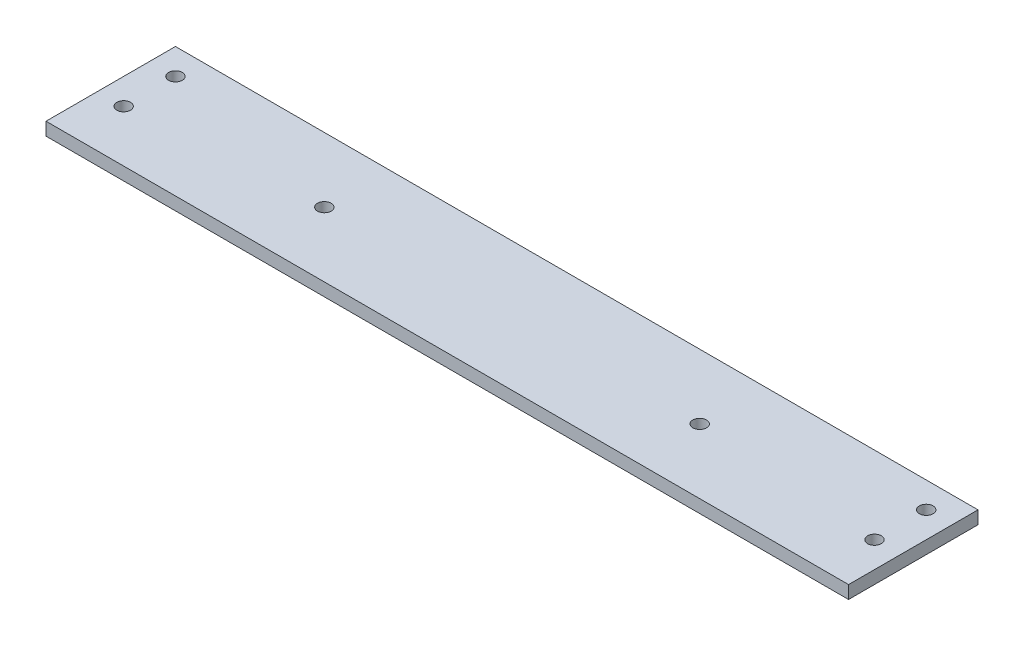
ISO-10303-21;
HEADER;
FILE_DESCRIPTION(('STEP AP214'),'2;1');
FILE_NAME('part.step','',(''),(''),'','','');
FILE_SCHEMA(('AUTOMOTIVE_DESIGN { 1 0 10303 214 1 1 1 1 }'));
ENDSEC;
DATA;
#1=APPLICATION_CONTEXT('core data for automotive mechanical design processes');
#2=APPLICATION_PROTOCOL_DEFINITION('international standard','automotive_design',2000,#1);
#3=PRODUCT_CONTEXT('',#1,'mechanical');
#4=PRODUCT('Part','Part','',(#3));
#5=PRODUCT_RELATED_PRODUCT_CATEGORY('part','',(#4));
#6=PRODUCT_DEFINITION_FORMATION('','',#4);
#7=PRODUCT_DEFINITION_CONTEXT('part definition',#1,'design');
#8=PRODUCT_DEFINITION('design','',#6,#7);
#9=PRODUCT_DEFINITION_SHAPE('','',#8);
#10=(LENGTH_UNIT() NAMED_UNIT(*) SI_UNIT(.MILLI.,.METRE.));
#11=(NAMED_UNIT(*) PLANE_ANGLE_UNIT() SI_UNIT($,.RADIAN.));
#12=(NAMED_UNIT(*) SI_UNIT($,.STERADIAN.) SOLID_ANGLE_UNIT());
#13=UNCERTAINTY_MEASURE_WITH_UNIT(LENGTH_MEASURE(1.E-05),#10,'distance_accuracy_value','');
#14=(GEOMETRIC_REPRESENTATION_CONTEXT(3) GLOBAL_UNCERTAINTY_ASSIGNED_CONTEXT((#13)) GLOBAL_UNIT_ASSIGNED_CONTEXT((#10,
#11,#12)) REPRESENTATION_CONTEXT('',''));
#15=CARTESIAN_POINT('',(0.,0.,0.));
#16=DIRECTION('',(0.,0.,1.));
#17=DIRECTION('',(1.,0.,0.));
#18=AXIS2_PLACEMENT_3D('',#15,#16,#17);
#19=CARTESIAN_POINT('',(196.85,6.35,31.75));
#20=DIRECTION('',(-1.,0.,0.));
#21=DIRECTION('',(0.,0.,1.));
#22=AXIS2_PLACEMENT_3D('',#19,#20,#21);
#23=PLANE('',#22);
#24=DIRECTION('',(0.,0.,-1.));
#25=VECTOR('',#24,1.);
#26=CARTESIAN_POINT('',(196.85,0.,31.75));
#27=LINE('',#26,#25);
#28=CARTESIAN_POINT('',(196.85,0.,31.75));
#29=VERTEX_POINT('',#28);
#30=CARTESIAN_POINT('',(196.85,0.,-31.75));
#31=VERTEX_POINT('',#30);
#32=EDGE_CURVE('E115',#29,#31,#27,.T.);
#33=ORIENTED_EDGE('',*,*,#32,.T.);
#34=DIRECTION('',(0.,-1.,0.));
#35=VECTOR('',#34,1.);
#36=CARTESIAN_POINT('',(196.85,6.35,-31.75));
#37=LINE('',#36,#35);
#38=CARTESIAN_POINT('',(196.85,6.35,-31.75));
#39=VERTEX_POINT('',#38);
#40=EDGE_CURVE('E11',#39,#31,#37,.T.);
#41=ORIENTED_EDGE('',*,*,#40,.F.);
#42=DIRECTION('',(0.,0.,-1.));
#43=VECTOR('',#42,1.);
#44=CARTESIAN_POINT('',(196.85,6.35,31.75));
#45=LINE('',#44,#43);
#46=CARTESIAN_POINT('',(196.85,6.35,31.75));
#47=VERTEX_POINT('',#46);
#48=EDGE_CURVE('E98',#47,#39,#45,.T.);
#49=ORIENTED_EDGE('',*,*,#48,.F.);
#50=DIRECTION('',(0.,-1.,0.));
#51=VECTOR('',#50,1.);
#52=CARTESIAN_POINT('',(196.85,6.35,31.75));
#53=LINE('',#52,#51);
#54=EDGE_CURVE('E111',#47,#29,#53,.T.);
#55=ORIENTED_EDGE('',*,*,#54,.T.);
#56=EDGE_LOOP('',(#33,#41,#49,#55));
#57=FACE_BOUND('',#56,.T.);
#58=ADVANCED_FACE('F46',(#57),#23,.F.);
#59=CARTESIAN_POINT('',(-196.85,6.35,-31.75));
#60=DIRECTION('',(0.,0.,1.));
#61=DIRECTION('',(1.,0.,0.));
#62=AXIS2_PLACEMENT_3D('',#59,#60,#61);
#63=PLANE('',#62);
#64=DIRECTION('',(-1.,0.,0.));
#65=VECTOR('',#64,1.);
#66=CARTESIAN_POINT('',(-196.85,0.,-31.75));
#67=LINE('',#66,#65);
#68=CARTESIAN_POINT('',(-196.85,0.,-31.75));
#69=VERTEX_POINT('',#68);
#70=EDGE_CURVE('E103',#31,#69,#67,.T.);
#71=ORIENTED_EDGE('',*,*,#70,.T.);
#72=DIRECTION('',(0.,-1.,0.));
#73=VECTOR('',#72,1.);
#74=CARTESIAN_POINT('',(-196.85,6.35,-31.75));
#75=LINE('',#74,#73);
#76=CARTESIAN_POINT('',(-196.85,6.35,-31.75));
#77=VERTEX_POINT('',#76);
#78=EDGE_CURVE('E55',#77,#69,#75,.T.);
#79=ORIENTED_EDGE('',*,*,#78,.F.);
#80=DIRECTION('',(-1.,0.,0.));
#81=VECTOR('',#80,1.);
#82=CARTESIAN_POINT('',(-196.85,6.35,-31.75));
#83=LINE('',#82,#81);
#84=EDGE_CURVE('E93',#39,#77,#83,.T.);
#85=ORIENTED_EDGE('',*,*,#84,.F.);
#86=ORIENTED_EDGE('',*,*,#40,.T.);
#87=EDGE_LOOP('',(#71,#79,#85,#86));
#88=FACE_BOUND('',#87,.T.);
#89=ADVANCED_FACE('F102',(#88),#63,.F.);
#90=CARTESIAN_POINT('',(-196.85,6.35,31.75));
#91=DIRECTION('',(1.,0.,0.));
#92=DIRECTION('',(0.,0.,-1.));
#93=AXIS2_PLACEMENT_3D('',#90,#91,#92);
#94=PLANE('',#93);
#95=DIRECTION('',(0.,0.,1.));
#96=VECTOR('',#95,1.);
#97=CARTESIAN_POINT('',(-196.85,0.,31.75));
#98=LINE('',#97,#96);
#99=CARTESIAN_POINT('',(-196.85,0.,31.75));
#100=VERTEX_POINT('',#99);
#101=EDGE_CURVE('E80',#69,#100,#98,.T.);
#102=ORIENTED_EDGE('',*,*,#101,.T.);
#103=DIRECTION('',(0.,-1.,0.));
#104=VECTOR('',#103,1.);
#105=CARTESIAN_POINT('',(-196.85,6.35,31.75));
#106=LINE('',#105,#104);
#107=CARTESIAN_POINT('',(-196.85,6.35,31.75));
#108=VERTEX_POINT('',#107);
#109=EDGE_CURVE('E105',#108,#100,#106,.T.);
#110=ORIENTED_EDGE('',*,*,#109,.F.);
#111=DIRECTION('',(0.,0.,1.));
#112=VECTOR('',#111,1.);
#113=CARTESIAN_POINT('',(-196.85,6.35,31.75));
#114=LINE('',#113,#112);
#115=EDGE_CURVE('E96',#77,#108,#114,.T.);
#116=ORIENTED_EDGE('',*,*,#115,.F.);
#117=ORIENTED_EDGE('',*,*,#78,.T.);
#118=EDGE_LOOP('',(#102,#110,#116,#117));
#119=FACE_BOUND('',#118,.T.);
#120=ADVANCED_FACE('F106',(#119),#94,.F.);
#121=CARTESIAN_POINT('',(-196.85,6.35,31.75));
#122=DIRECTION('',(0.,0.,-1.));
#123=DIRECTION('',(-1.,0.,0.));
#124=AXIS2_PLACEMENT_3D('',#121,#122,#123);
#125=PLANE('',#124);
#126=DIRECTION('',(1.,0.,0.));
#127=VECTOR('',#126,1.);
#128=CARTESIAN_POINT('',(-196.85,0.,31.75));
#129=LINE('',#128,#127);
#130=EDGE_CURVE('E86',#100,#29,#129,.T.);
#131=ORIENTED_EDGE('',*,*,#130,.T.);
#132=ORIENTED_EDGE('',*,*,#54,.F.);
#133=DIRECTION('',(1.,0.,0.));
#134=VECTOR('',#133,1.);
#135=CARTESIAN_POINT('',(-196.85,6.35,31.75));
#136=LINE('',#135,#134);
#137=EDGE_CURVE('E63',#108,#47,#136,.T.);
#138=ORIENTED_EDGE('',*,*,#137,.F.);
#139=ORIENTED_EDGE('',*,*,#109,.T.);
#140=EDGE_LOOP('',(#131,#132,#138,#139));
#141=FACE_BOUND('',#140,.T.);
#142=ADVANCED_FACE('F130',(#141),#125,.F.);
#143=CARTESIAN_POINT('',(0.,6.35,0.));
#144=DIRECTION('',(0.,-1.,0.));
#145=DIRECTION('',(0.,0.,-1.));
#146=AXIS2_PLACEMENT_3D('',#143,#144,#145);
#147=PLANE('',#146);
#148=CARTESIAN_POINT('',(-184.15,6.35,6.35));
#149=DIRECTION('',(0.,-1.,0.));
#150=DIRECTION('',(0.,0.,-1.));
#151=AXIS2_PLACEMENT_3D('',#148,#149,#150);
#152=CIRCLE('',#151,3.36549999999999);
#153=CARTESIAN_POINT('',(-184.15,6.35,2.98450000000001));
#154=VERTEX_POINT('',#153);
#155=EDGE_CURVE('E142',#154,#154,#152,.T.);
#156=ORIENTED_EDGE('',*,*,#155,.T.);
#157=EDGE_LOOP('',(#156));
#158=FACE_BOUND('',#157,.T.);
#159=CARTESIAN_POINT('',(-184.15,6.35,-19.05));
#160=DIRECTION('',(0.,-1.,0.));
#161=DIRECTION('',(0.,0.,-1.));
#162=AXIS2_PLACEMENT_3D('',#159,#160,#161);
#163=CIRCLE('',#162,3.36549999999999);
#164=CARTESIAN_POINT('',(-184.15,6.35,-22.4155));
#165=VERTEX_POINT('',#164);
#166=EDGE_CURVE('E167',#165,#165,#163,.T.);
#167=ORIENTED_EDGE('',*,*,#166,.T.);
#168=EDGE_LOOP('',(#167));
#169=FACE_BOUND('',#168,.T.);
#170=CARTESIAN_POINT('',(92.0750000000001,6.35,1.11022302462516E-13));
#171=DIRECTION('',(0.,-1.,0.));
#172=DIRECTION('',(0.,0.,-1.));
#173=AXIS2_PLACEMENT_3D('',#170,#171,#172);
#174=CIRCLE('',#173,3.36549999999999);
#175=CARTESIAN_POINT('',(92.0750000000001,6.35,-3.36549999999988));
#176=VERTEX_POINT('',#175);
#177=EDGE_CURVE('E159',#176,#176,#174,.T.);
#178=ORIENTED_EDGE('',*,*,#177,.T.);
#179=EDGE_LOOP('',(#178));
#180=FACE_BOUND('',#179,.T.);
#181=CARTESIAN_POINT('',(184.15,6.35,6.35));
#182=DIRECTION('',(0.,-1.,0.));
#183=DIRECTION('',(0.,0.,-1.));
#184=AXIS2_PLACEMENT_3D('',#181,#182,#183);
#185=CIRCLE('',#184,3.36549999999999);
#186=CARTESIAN_POINT('',(184.15,6.35,2.98450000000001));
#187=VERTEX_POINT('',#186);
#188=EDGE_CURVE('E150',#187,#187,#185,.T.);
#189=ORIENTED_EDGE('',*,*,#188,.T.);
#190=EDGE_LOOP('',(#189));
#191=FACE_BOUND('',#190,.T.);
#192=CARTESIAN_POINT('',(184.15,6.35,-19.05));
#193=DIRECTION('',(0.,-1.,0.));
#194=DIRECTION('',(0.,0.,-1.));
#195=AXIS2_PLACEMENT_3D('',#192,#193,#194);
#196=CIRCLE('',#195,3.36549999999999);
#197=CARTESIAN_POINT('',(184.15,6.35,-22.4155));
#198=VERTEX_POINT('',#197);
#199=EDGE_CURVE('E151',#198,#198,#196,.T.);
#200=ORIENTED_EDGE('',*,*,#199,.T.);
#201=EDGE_LOOP('',(#200));
#202=FACE_BOUND('',#201,.T.);
#203=CARTESIAN_POINT('',(-92.0622678288608,6.35,1.14491749414469E-13));
#204=DIRECTION('',(0.,-1.,0.));
#205=DIRECTION('',(0.,0.,-1.));
#206=AXIS2_PLACEMENT_3D('',#203,#204,#205);
#207=CIRCLE('',#206,3.36549999999999);
#208=CARTESIAN_POINT('',(-92.0622678288608,6.35,-3.36549999999988));
#209=VERTEX_POINT('',#208);
#210=EDGE_CURVE('E119',#209,#209,#207,.T.);
#211=ORIENTED_EDGE('',*,*,#210,.T.);
#212=EDGE_LOOP('',(#211));
#213=FACE_BOUND('',#212,.T.);
#214=ORIENTED_EDGE('',*,*,#48,.T.);
#215=ORIENTED_EDGE('',*,*,#84,.T.);
#216=ORIENTED_EDGE('',*,*,#115,.T.);
#217=ORIENTED_EDGE('',*,*,#137,.T.);
#218=EDGE_LOOP('',(#214,#215,#216,#217));
#219=FACE_BOUND('',#218,.T.);
#220=ADVANCED_FACE('F94',(#158,#169,#180,#191,#202,#213,#219),#147,.F.);
#221=CARTESIAN_POINT('',(0.,0.,0.));
#222=DIRECTION('',(0.,-1.,0.));
#223=DIRECTION('',(0.,0.,-1.));
#224=AXIS2_PLACEMENT_3D('',#221,#222,#223);
#225=PLANE('',#224);
#226=CARTESIAN_POINT('',(-184.15,0.,6.35));
#227=DIRECTION('',(0.,-1.,0.));
#228=DIRECTION('',(0.,0.,-1.));
#229=AXIS2_PLACEMENT_3D('',#226,#227,#228);
#230=CIRCLE('',#229,3.36549999999999);
#231=CARTESIAN_POINT('',(-184.15,0.,2.98450000000001));
#232=VERTEX_POINT('',#231);
#233=EDGE_CURVE('E171',#232,#232,#230,.T.);
#234=ORIENTED_EDGE('',*,*,#233,.F.);
#235=EDGE_LOOP('',(#234));
#236=FACE_BOUND('',#235,.T.);
#237=CARTESIAN_POINT('',(-184.15,0.,-19.05));
#238=DIRECTION('',(0.,-1.,0.));
#239=DIRECTION('',(0.,0.,-1.));
#240=AXIS2_PLACEMENT_3D('',#237,#238,#239);
#241=CIRCLE('',#240,3.36549999999999);
#242=CARTESIAN_POINT('',(-184.15,0.,-22.4155));
#243=VERTEX_POINT('',#242);
#244=EDGE_CURVE('E163',#243,#243,#241,.T.);
#245=ORIENTED_EDGE('',*,*,#244,.F.);
#246=EDGE_LOOP('',(#245));
#247=FACE_BOUND('',#246,.T.);
#248=CARTESIAN_POINT('',(92.0750000000001,0.,1.11022302462516E-13));
#249=DIRECTION('',(0.,-1.,0.));
#250=DIRECTION('',(0.,0.,-1.));
#251=AXIS2_PLACEMENT_3D('',#248,#249,#250);
#252=CIRCLE('',#251,3.36549999999999);
#253=CARTESIAN_POINT('',(92.0750000000001,0.,-3.36549999999988));
#254=VERTEX_POINT('',#253);
#255=EDGE_CURVE('E155',#254,#254,#252,.T.);
#256=ORIENTED_EDGE('',*,*,#255,.F.);
#257=EDGE_LOOP('',(#256));
#258=FACE_BOUND('',#257,.T.);
#259=CARTESIAN_POINT('',(184.15,0.,6.35));
#260=DIRECTION('',(0.,-1.,0.));
#261=DIRECTION('',(0.,0.,-1.));
#262=AXIS2_PLACEMENT_3D('',#259,#260,#261);
#263=CIRCLE('',#262,3.36549999999999);
#264=CARTESIAN_POINT('',(184.15,0.,2.98450000000001));
#265=VERTEX_POINT('',#264);
#266=EDGE_CURVE('E146',#265,#265,#263,.T.);
#267=ORIENTED_EDGE('',*,*,#266,.F.);
#268=EDGE_LOOP('',(#267));
#269=FACE_BOUND('',#268,.T.);
#270=CARTESIAN_POINT('',(184.15,0.,-19.05));
#271=DIRECTION('',(0.,-1.,0.));
#272=DIRECTION('',(0.,0.,-1.));
#273=AXIS2_PLACEMENT_3D('',#270,#271,#272);
#274=CIRCLE('',#273,3.36549999999999);
#275=CARTESIAN_POINT('',(184.15,0.,-22.4155));
#276=VERTEX_POINT('',#275);
#277=EDGE_CURVE('E178',#276,#276,#274,.T.);
#278=ORIENTED_EDGE('',*,*,#277,.F.);
#279=EDGE_LOOP('',(#278));
#280=FACE_BOUND('',#279,.T.);
#281=CARTESIAN_POINT('',(-92.0622678288608,0.,1.14491749414469E-13));
#282=DIRECTION('',(0.,-1.,0.));
#283=DIRECTION('',(0.,0.,-1.));
#284=AXIS2_PLACEMENT_3D('',#281,#282,#283);
#285=CIRCLE('',#284,3.36549999999999);
#286=CARTESIAN_POINT('',(-92.0622678288608,0.,-3.36549999999988));
#287=VERTEX_POINT('',#286);
#288=EDGE_CURVE('E138',#287,#287,#285,.T.);
#289=ORIENTED_EDGE('',*,*,#288,.F.);
#290=EDGE_LOOP('',(#289));
#291=FACE_BOUND('',#290,.T.);
#292=ORIENTED_EDGE('',*,*,#32,.F.);
#293=ORIENTED_EDGE('',*,*,#130,.F.);
#294=ORIENTED_EDGE('',*,*,#101,.F.);
#295=ORIENTED_EDGE('',*,*,#70,.F.);
#296=EDGE_LOOP('',(#292,#293,#294,#295));
#297=FACE_BOUND('',#296,.T.);
#298=ADVANCED_FACE('F133',(#236,#247,#258,#269,#280,#291,#297),#225,.T.);
#299=CARTESIAN_POINT('',(-92.0622678288608,6.35,1.14491749414469E-13));
#300=DIRECTION('',(0.,-1.,0.));
#301=DIRECTION('',(0.,0.,-1.));
#302=AXIS2_PLACEMENT_3D('',#299,#300,#301);
#303=CYLINDRICAL_SURFACE('',#302,3.36549999999999);
#304=ORIENTED_EDGE('',*,*,#210,.F.);
#305=EDGE_LOOP('',(#304));
#306=FACE_BOUND('',#305,.T.);
#307=ORIENTED_EDGE('',*,*,#288,.T.);
#308=EDGE_LOOP('',(#307));
#309=FACE_BOUND('',#308,.T.);
#310=ADVANCED_FACE('F193',(#306,#309),#303,.F.);
#311=CARTESIAN_POINT('',(184.15,6.35,-19.05));
#312=DIRECTION('',(0.,-1.,0.));
#313=DIRECTION('',(0.,0.,-1.));
#314=AXIS2_PLACEMENT_3D('',#311,#312,#313);
#315=CYLINDRICAL_SURFACE('',#314,3.36549999999999);
#316=ORIENTED_EDGE('',*,*,#199,.F.);
#317=EDGE_LOOP('',(#316));
#318=FACE_BOUND('',#317,.T.);
#319=ORIENTED_EDGE('',*,*,#277,.T.);
#320=EDGE_LOOP('',(#319));
#321=FACE_BOUND('',#320,.T.);
#322=ADVANCED_FACE('F189',(#318,#321),#315,.F.);
#323=CARTESIAN_POINT('',(184.15,6.35,6.35));
#324=DIRECTION('',(0.,-1.,0.));
#325=DIRECTION('',(0.,0.,-1.));
#326=AXIS2_PLACEMENT_3D('',#323,#324,#325);
#327=CYLINDRICAL_SURFACE('',#326,3.36549999999999);
#328=ORIENTED_EDGE('',*,*,#188,.F.);
#329=EDGE_LOOP('',(#328));
#330=FACE_BOUND('',#329,.T.);
#331=ORIENTED_EDGE('',*,*,#266,.T.);
#332=EDGE_LOOP('',(#331));
#333=FACE_BOUND('',#332,.T.);
#334=ADVANCED_FACE('F192',(#330,#333),#327,.F.);
#335=CARTESIAN_POINT('',(92.0750000000001,6.35,1.11022302462516E-13));
#336=DIRECTION('',(0.,-1.,0.));
#337=DIRECTION('',(0.,0.,-1.));
#338=AXIS2_PLACEMENT_3D('',#335,#336,#337);
#339=CYLINDRICAL_SURFACE('',#338,3.36549999999999);
#340=ORIENTED_EDGE('',*,*,#177,.F.);
#341=EDGE_LOOP('',(#340));
#342=FACE_BOUND('',#341,.T.);
#343=ORIENTED_EDGE('',*,*,#255,.T.);
#344=EDGE_LOOP('',(#343));
#345=FACE_BOUND('',#344,.T.);
#346=ADVANCED_FACE('F235',(#342,#345),#339,.F.);
#347=CARTESIAN_POINT('',(-184.15,6.35,-19.05));
#348=DIRECTION('',(0.,-1.,0.));
#349=DIRECTION('',(0.,0.,-1.));
#350=AXIS2_PLACEMENT_3D('',#347,#348,#349);
#351=CYLINDRICAL_SURFACE('',#350,3.36549999999999);
#352=ORIENTED_EDGE('',*,*,#166,.F.);
#353=EDGE_LOOP('',(#352));
#354=FACE_BOUND('',#353,.T.);
#355=ORIENTED_EDGE('',*,*,#244,.T.);
#356=EDGE_LOOP('',(#355));
#357=FACE_BOUND('',#356,.T.);
#358=ADVANCED_FACE('F241',(#354,#357),#351,.F.);
#359=CARTESIAN_POINT('',(-184.15,6.35,6.35));
#360=DIRECTION('',(0.,-1.,0.));
#361=DIRECTION('',(0.,0.,-1.));
#362=AXIS2_PLACEMENT_3D('',#359,#360,#361);
#363=CYLINDRICAL_SURFACE('',#362,3.36549999999999);
#364=ORIENTED_EDGE('',*,*,#155,.F.);
#365=EDGE_LOOP('',(#364));
#366=FACE_BOUND('',#365,.T.);
#367=ORIENTED_EDGE('',*,*,#233,.T.);
#368=EDGE_LOOP('',(#367));
#369=FACE_BOUND('',#368,.T.);
#370=ADVANCED_FACE('F247',(#366,#369),#363,.F.);
#371=CLOSED_SHELL('',(#58,#89,#120,#142,#220,#298,#310,#322,#334,#346,#358,#370));
#372=MANIFOLD_SOLID_BREP('B2',#371);
#373=ADVANCED_BREP_SHAPE_REPRESENTATION('',(#18,#372),#14);
#374=SHAPE_DEFINITION_REPRESENTATION(#9,#373);
ENDSEC;
END-ISO-10303-21;
